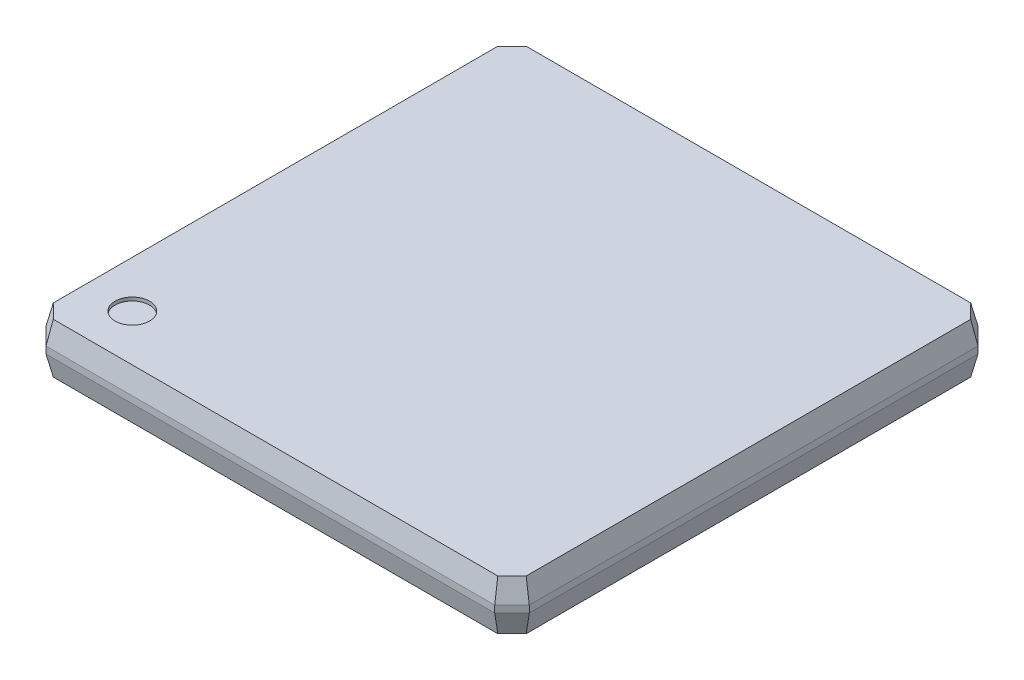
ISO-10303-21;
HEADER;
FILE_DESCRIPTION(('STEP AP214'),'2;1');
FILE_NAME('part.step','',(''),(''),'','','');
FILE_SCHEMA(('AUTOMOTIVE_DESIGN { 1 0 10303 214 1 1 1 1 }'));
ENDSEC;
DATA;
#1=APPLICATION_CONTEXT('core data for automotive mechanical design processes');
#2=APPLICATION_PROTOCOL_DEFINITION('international standard','automotive_design',2000,#1);
#3=PRODUCT_CONTEXT('',#1,'mechanical');
#4=PRODUCT('Part','Part','',(#3));
#5=PRODUCT_RELATED_PRODUCT_CATEGORY('part','',(#4));
#6=PRODUCT_DEFINITION_FORMATION('','',#4);
#7=PRODUCT_DEFINITION_CONTEXT('part definition',#1,'design');
#8=PRODUCT_DEFINITION('design','',#6,#7);
#9=PRODUCT_DEFINITION_SHAPE('','',#8);
#10=(LENGTH_UNIT() NAMED_UNIT(*) SI_UNIT(.MILLI.,.METRE.));
#11=(NAMED_UNIT(*) PLANE_ANGLE_UNIT() SI_UNIT($,.RADIAN.));
#12=(NAMED_UNIT(*) SI_UNIT($,.STERADIAN.) SOLID_ANGLE_UNIT());
#13=UNCERTAINTY_MEASURE_WITH_UNIT(LENGTH_MEASURE(1.E-05),#10,'distance_accuracy_value','');
#14=(GEOMETRIC_REPRESENTATION_CONTEXT(3) GLOBAL_UNCERTAINTY_ASSIGNED_CONTEXT((#13)) GLOBAL_UNIT_ASSIGNED_CONTEXT((#10,
#11,#12)) REPRESENTATION_CONTEXT('',''));
#15=CARTESIAN_POINT('',(0.,0.,0.));
#16=DIRECTION('',(0.,0.,1.));
#17=DIRECTION('',(1.,0.,0.));
#18=AXIS2_PLACEMENT_3D('',#15,#16,#17);
#19=CARTESIAN_POINT('',(-5.5,1.5,5.5));
#20=DIRECTION('',(0.,1.,0.));
#21=DIRECTION('',(0.,0.,1.));
#22=AXIS2_PLACEMENT_3D('',#19,#20,#21);
#23=PLANE('',#22);
#24=CARTESIAN_POINT('',(-5.5,1.5,5.5));
#25=DIRECTION('',(0.,-1.,0.));
#26=DIRECTION('',(0.,0.,-1.));
#27=AXIS2_PLACEMENT_3D('',#24,#25,#26);
#28=CIRCLE('',#27,0.5);
#29=CARTESIAN_POINT('',(-5.5,1.5,5.));
#30=VERTEX_POINT('',#29);
#31=EDGE_CURVE('E19',#30,#30,#28,.F.);
#32=ORIENTED_EDGE('',*,*,#31,.T.);
#33=EDGE_LOOP('',(#32));
#34=FACE_BOUND('',#33,.T.);
#35=ADVANCED_FACE('F16',(#34),#23,.T.);
#36=CARTESIAN_POINT('',(-5.5,1.6,5.5));
#37=DIRECTION('',(0.,-1.,0.));
#38=DIRECTION('',(0.,0.,-1.));
#39=AXIS2_PLACEMENT_3D('',#36,#37,#38);
#40=CYLINDRICAL_SURFACE('',#39,0.5);
#41=CARTESIAN_POINT('',(-5.5,1.6,5.5));
#42=DIRECTION('',(0.,-1.,0.));
#43=DIRECTION('',(0.,0.,-1.));
#44=AXIS2_PLACEMENT_3D('',#41,#42,#43);
#45=CIRCLE('',#44,0.5);
#46=CARTESIAN_POINT('',(-5.5,1.6,5.));
#47=VERTEX_POINT('',#46);
#48=EDGE_CURVE('E141',#47,#47,#45,.T.);
#49=ORIENTED_EDGE('',*,*,#48,.F.);
#50=EDGE_LOOP('',(#49));
#51=FACE_BOUND('',#50,.T.);
#52=ORIENTED_EDGE('',*,*,#31,.F.);
#53=EDGE_LOOP('',(#52));
#54=FACE_BOUND('',#53,.T.);
#55=ADVANCED_FACE('F163',(#51,#54),#40,.F.);
#56=CARTESIAN_POINT('',(0.,1.6,-7.));
#57=DIRECTION('',(0.,1.,0.));
#58=DIRECTION('',(0.,0.,1.));
#59=AXIS2_PLACEMENT_3D('',#56,#57,#58);
#60=PLANE('',#59);
#61=DIRECTION('',(0.707106781186548,0.,0.707106781186548));
#62=VECTOR('',#61,1.);
#63=CARTESIAN_POINT('',(-8.39393398282202,1.6,4.89393398282202));
#64=LINE('',#63,#62);
#65=CARTESIAN_POINT('',(-6.43786796564403,1.6,6.85));
#66=VERTEX_POINT('',#65);
#67=CARTESIAN_POINT('',(-6.85,1.6,6.43786796564403));
#68=VERTEX_POINT('',#67);
#69=EDGE_CURVE('E146',#66,#68,#64,.F.);
#70=ORIENTED_EDGE('',*,*,#69,.F.);
#71=DIRECTION('',(1.,0.,0.));
#72=VECTOR('',#71,1.);
#73=CARTESIAN_POINT('',(0.,1.6,6.85));
#74=LINE('',#73,#72);
#75=CARTESIAN_POINT('',(6.43786796564403,1.6,6.85));
#76=VERTEX_POINT('',#75);
#77=EDGE_CURVE('E127',#76,#66,#74,.F.);
#78=ORIENTED_EDGE('',*,*,#77,.F.);
#79=DIRECTION('',(0.707106781186548,0.,-0.707106781186548));
#80=VECTOR('',#79,1.);
#81=CARTESIAN_POINT('',(8.39393398282202,1.6,4.89393398282202));
#82=LINE('',#81,#80);
#83=CARTESIAN_POINT('',(6.85,1.6,6.43786796564403));
#84=VERTEX_POINT('',#83);
#85=EDGE_CURVE('E132',#84,#76,#82,.F.);
#86=ORIENTED_EDGE('',*,*,#85,.F.);
#87=DIRECTION('',(0.,0.,1.));
#88=VECTOR('',#87,1.);
#89=CARTESIAN_POINT('',(6.85,1.6,-7.));
#90=LINE('',#89,#88);
#91=CARTESIAN_POINT('',(6.85,1.6,-6.43786796564403));
#92=VERTEX_POINT('',#91);
#93=EDGE_CURVE('E471',#92,#84,#90,.T.);
#94=ORIENTED_EDGE('',*,*,#93,.F.);
#95=DIRECTION('',(-0.707106781186548,0.,-0.707106781186547));
#96=VECTOR('',#95,1.);
#97=CARTESIAN_POINT('',(4.89393398282202,1.6,-8.39393398282202));
#98=LINE('',#97,#96);
#99=CARTESIAN_POINT('',(6.43786796564403,1.6,-6.85));
#100=VERTEX_POINT('',#99);
#101=EDGE_CURVE('E465',#100,#92,#98,.F.);
#102=ORIENTED_EDGE('',*,*,#101,.F.);
#103=DIRECTION('',(1.,0.,0.));
#104=VECTOR('',#103,1.);
#105=CARTESIAN_POINT('',(0.,1.6,-6.85));
#106=LINE('',#105,#104);
#107=CARTESIAN_POINT('',(-6.43786796564403,1.6,-6.85));
#108=VERTEX_POINT('',#107);
#109=EDGE_CURVE('E460',#108,#100,#106,.T.);
#110=ORIENTED_EDGE('',*,*,#109,.F.);
#111=DIRECTION('',(-0.707106781186548,0.,0.707106781186547));
#112=VECTOR('',#111,1.);
#113=CARTESIAN_POINT('',(-4.89393398282202,1.6,-8.39393398282202));
#114=LINE('',#113,#112);
#115=CARTESIAN_POINT('',(-6.85,1.6,-6.43786796564403));
#116=VERTEX_POINT('',#115);
#117=EDGE_CURVE('E455',#116,#108,#114,.F.);
#118=ORIENTED_EDGE('',*,*,#117,.F.);
#119=DIRECTION('',(0.,0.,1.));
#120=VECTOR('',#119,1.);
#121=CARTESIAN_POINT('',(-6.85,1.6,-7.));
#122=LINE('',#121,#120);
#123=EDGE_CURVE('E450',#68,#116,#122,.F.);
#124=ORIENTED_EDGE('',*,*,#123,.F.);
#125=EDGE_LOOP('',(#70,#78,#86,#94,#102,#110,#118,#124));
#126=FACE_BOUND('',#125,.T.);
#127=ORIENTED_EDGE('',*,*,#48,.T.);
#128=EDGE_LOOP('',(#127));
#129=FACE_BOUND('',#128,.T.);
#130=ADVANCED_FACE('F143',(#126,#129),#60,.T.);
#131=CARTESIAN_POINT('',(8.44696699141101,1.2875,4.94696699141101));
#132=DIRECTION('',(0.687581655170114,0.233372952475328,0.687581655170114));
#133=DIRECTION('',(0.707106781186548,0.,-0.707106781186548));
#134=AXIS2_PLACEMENT_3D('',#131,#132,#133);
#135=PLANE('',#134);
#136=DIRECTION('',(0.232290174282964,-0.967875726179023,0.0962177405940241));
#137=VECTOR('',#136,1.);
#138=CARTESIAN_POINT('',(6.85,1.6,6.43786796564403));
#139=LINE('',#138,#137);
#140=CARTESIAN_POINT('',(7.,0.975,6.5));
#141=VERTEX_POINT('',#140);
#142=EDGE_CURVE('E137',#84,#141,#139,.T.);
#143=ORIENTED_EDGE('',*,*,#142,.F.);
#144=ORIENTED_EDGE('',*,*,#85,.T.);
#145=DIRECTION('',(-0.0962177405940241,0.967875726179022,-0.232290174282967));
#146=VECTOR('',#145,1.);
#147=CARTESIAN_POINT('',(6.5,0.975,7.));
#148=LINE('',#147,#146);
#149=CARTESIAN_POINT('',(6.5,0.975,7.));
#150=VERTEX_POINT('',#149);
#151=EDGE_CURVE('E134',#150,#76,#148,.T.);
#152=ORIENTED_EDGE('',*,*,#151,.F.);
#153=DIRECTION('',(0.707106781186547,0.,-0.707106781186548));
#154=VECTOR('',#153,1.);
#155=CARTESIAN_POINT('',(6.75,0.974999999999999,6.75));
#156=LINE('',#155,#154);
#157=EDGE_CURVE('E473',#141,#150,#156,.F.);
#158=ORIENTED_EDGE('',*,*,#157,.F.);
#159=EDGE_LOOP('',(#143,#144,#152,#158));
#160=FACE_BOUND('',#159,.T.);
#161=ADVANCED_FACE('F133',(#160),#135,.T.);
#162=CARTESIAN_POINT('',(0.,1.2875,6.925));
#163=DIRECTION('',(0.,0.233372952475326,0.972387301980517));
#164=DIRECTION('',(0.,-0.972387301980517,0.233372952475326));
#165=AXIS2_PLACEMENT_3D('',#162,#163,#164);
#166=PLANE('',#165);
#167=DIRECTION('',(0.096217740594024,0.967875726179024,-0.232290174282962));
#168=VECTOR('',#167,1.);
#169=CARTESIAN_POINT('',(-6.5,0.975,7.));
#170=LINE('',#169,#168);
#171=CARTESIAN_POINT('',(-6.5,0.975,7.));
#172=VERTEX_POINT('',#171);
#173=EDGE_CURVE('E148',#172,#66,#170,.T.);
#174=ORIENTED_EDGE('',*,*,#173,.F.);
#175=DIRECTION('',(1.,0.,0.));
#176=VECTOR('',#175,1.);
#177=CARTESIAN_POINT('',(0.,0.974999999999999,7.));
#178=LINE('',#177,#176);
#179=EDGE_CURVE('E153',#150,#172,#178,.F.);
#180=ORIENTED_EDGE('',*,*,#179,.F.);
#181=ORIENTED_EDGE('',*,*,#151,.T.);
#182=ORIENTED_EDGE('',*,*,#77,.T.);
#183=EDGE_LOOP('',(#174,#180,#181,#182));
#184=FACE_BOUND('',#183,.T.);
#185=ADVANCED_FACE('F151',(#184),#166,.T.);
#186=CARTESIAN_POINT('',(-8.44696699141101,1.2875,4.94696699141101));
#187=DIRECTION('',(-0.687581655170114,0.233372952475328,0.687581655170114));
#188=DIRECTION('',(0.707106781186548,0.,0.707106781186548));
#189=AXIS2_PLACEMENT_3D('',#186,#187,#188);
#190=PLANE('',#189);
#191=ORIENTED_EDGE('',*,*,#173,.T.);
#192=ORIENTED_EDGE('',*,*,#69,.T.);
#193=DIRECTION('',(0.232290174282964,0.967875726179023,-0.0962177405940241));
#194=VECTOR('',#193,1.);
#195=CARTESIAN_POINT('',(-7.,0.975,6.5));
#196=LINE('',#195,#194);
#197=CARTESIAN_POINT('',(-7.,0.975,6.5));
#198=VERTEX_POINT('',#197);
#199=EDGE_CURVE('E445',#198,#68,#196,.T.);
#200=ORIENTED_EDGE('',*,*,#199,.F.);
#201=DIRECTION('',(0.707106781186547,0.,0.707106781186548));
#202=VECTOR('',#201,1.);
#203=CARTESIAN_POINT('',(-6.75,0.974999999999999,6.75));
#204=LINE('',#203,#202);
#205=EDGE_CURVE('E443',#172,#198,#204,.F.);
#206=ORIENTED_EDGE('',*,*,#205,.F.);
#207=EDGE_LOOP('',(#191,#192,#200,#206));
#208=FACE_BOUND('',#207,.T.);
#209=ADVANCED_FACE('F262',(#208),#190,.T.);
#210=CARTESIAN_POINT('',(-6.925,1.2875,-7.));
#211=DIRECTION('',(-0.972387301980518,0.233372952475323,0.));
#212=DIRECTION('',(-0.233372952475323,-0.972387301980518,0.));
#213=AXIS2_PLACEMENT_3D('',#210,#211,#212);
#214=PLANE('',#213);
#215=DIRECTION('',(0.23229017428296,0.967875726179024,0.0962177405940227));
#216=VECTOR('',#215,1.);
#217=CARTESIAN_POINT('',(-7.,0.975,-6.5));
#218=LINE('',#217,#216);
#219=CARTESIAN_POINT('',(-7.,0.974999999999999,-6.5));
#220=VERTEX_POINT('',#219);
#221=EDGE_CURVE('E452',#220,#116,#218,.T.);
#222=ORIENTED_EDGE('',*,*,#221,.F.);
#223=DIRECTION('',(0.,0.,1.));
#224=VECTOR('',#223,1.);
#225=CARTESIAN_POINT('',(-7.,0.974999999999999,-7.));
#226=LINE('',#225,#224);
#227=EDGE_CURVE('E484',#198,#220,#226,.F.);
#228=ORIENTED_EDGE('',*,*,#227,.F.);
#229=ORIENTED_EDGE('',*,*,#199,.T.);
#230=ORIENTED_EDGE('',*,*,#123,.T.);
#231=EDGE_LOOP('',(#222,#228,#229,#230));
#232=FACE_BOUND('',#231,.T.);
#233=ADVANCED_FACE('F258',(#232),#214,.T.);
#234=CARTESIAN_POINT('',(-4.94696699141101,1.2875,-8.44696699141101));
#235=DIRECTION('',(-0.687581655170115,0.233372952475326,-0.687581655170115));
#236=DIRECTION('',(-0.707106781186548,0.,0.707106781186547));
#237=AXIS2_PLACEMENT_3D('',#234,#235,#236);
#238=PLANE('',#237);
#239=ORIENTED_EDGE('',*,*,#221,.T.);
#240=ORIENTED_EDGE('',*,*,#117,.T.);
#241=DIRECTION('',(0.096217740594024,0.967875726179023,0.232290174282965));
#242=VECTOR('',#241,1.);
#243=CARTESIAN_POINT('',(-6.5,0.974999999999999,-7.));
#244=LINE('',#243,#242);
#245=CARTESIAN_POINT('',(-6.5,0.974999999999999,-7.));
#246=VERTEX_POINT('',#245);
#247=EDGE_CURVE('E457',#246,#108,#244,.T.);
#248=ORIENTED_EDGE('',*,*,#247,.F.);
#249=DIRECTION('',(-0.707106781186547,0.,0.707106781186548));
#250=VECTOR('',#249,1.);
#251=CARTESIAN_POINT('',(-6.75,0.974999999999999,-6.75));
#252=LINE('',#251,#250);
#253=EDGE_CURVE('E490',#220,#246,#252,.F.);
#254=ORIENTED_EDGE('',*,*,#253,.F.);
#255=EDGE_LOOP('',(#239,#240,#248,#254));
#256=FACE_BOUND('',#255,.T.);
#257=ADVANCED_FACE('F254',(#256),#238,.T.);
#258=CARTESIAN_POINT('',(0.,1.2875,-6.925));
#259=DIRECTION('',(0.,0.233372952475324,-0.972387301980518));
#260=DIRECTION('',(0.,0.972387301980518,0.233372952475324));
#261=AXIS2_PLACEMENT_3D('',#258,#259,#260);
#262=PLANE('',#261);
#263=DIRECTION('',(-0.0962177405940227,0.967875726179024,0.23229017428296));
#264=VECTOR('',#263,1.);
#265=CARTESIAN_POINT('',(6.5,0.975,-7.));
#266=LINE('',#265,#264);
#267=CARTESIAN_POINT('',(6.5,0.974999999999999,-7.));
#268=VERTEX_POINT('',#267);
#269=EDGE_CURVE('E462',#268,#100,#266,.T.);
#270=ORIENTED_EDGE('',*,*,#269,.F.);
#271=DIRECTION('',(1.,0.,0.));
#272=VECTOR('',#271,1.);
#273=CARTESIAN_POINT('',(0.,0.974999999999999,-7.));
#274=LINE('',#273,#272);
#275=EDGE_CURVE('E493',#268,#246,#274,.F.);
#276=ORIENTED_EDGE('',*,*,#275,.T.);
#277=ORIENTED_EDGE('',*,*,#247,.T.);
#278=ORIENTED_EDGE('',*,*,#109,.T.);
#279=EDGE_LOOP('',(#270,#276,#277,#278));
#280=FACE_BOUND('',#279,.T.);
#281=ADVANCED_FACE('F250',(#280),#262,.T.);
#282=CARTESIAN_POINT('',(4.94696699141101,1.2875,-8.44696699141101));
#283=DIRECTION('',(0.687581655170115,0.233372952475326,-0.687581655170115));
#284=DIRECTION('',(-0.707106781186548,0.,-0.707106781186547));
#285=AXIS2_PLACEMENT_3D('',#282,#283,#284);
#286=PLANE('',#285);
#287=ORIENTED_EDGE('',*,*,#269,.T.);
#288=ORIENTED_EDGE('',*,*,#101,.T.);
#289=DIRECTION('',(-0.232290174282964,0.967875726179023,0.0962177405940241));
#290=VECTOR('',#289,1.);
#291=CARTESIAN_POINT('',(7.,0.975,-6.5));
#292=LINE('',#291,#290);
#293=CARTESIAN_POINT('',(7.,0.975,-6.5));
#294=VERTEX_POINT('',#293);
#295=EDGE_CURVE('E468',#294,#92,#292,.T.);
#296=ORIENTED_EDGE('',*,*,#295,.F.);
#297=DIRECTION('',(-0.707106781186547,0.,-0.707106781186548));
#298=VECTOR('',#297,1.);
#299=CARTESIAN_POINT('',(6.75,0.974999999999999,-6.75));
#300=LINE('',#299,#298);
#301=EDGE_CURVE('E501',#268,#294,#300,.F.);
#302=ORIENTED_EDGE('',*,*,#301,.F.);
#303=EDGE_LOOP('',(#287,#288,#296,#302));
#304=FACE_BOUND('',#303,.T.);
#305=ADVANCED_FACE('F246',(#304),#286,.T.);
#306=CARTESIAN_POINT('',(6.925,1.2875,-7.));
#307=DIRECTION('',(0.972387301980518,0.233372952475323,0.));
#308=DIRECTION('',(-0.233372952475323,0.972387301980518,0.));
#309=AXIS2_PLACEMENT_3D('',#306,#307,#308);
#310=PLANE('',#309);
#311=ORIENTED_EDGE('',*,*,#295,.T.);
#312=ORIENTED_EDGE('',*,*,#93,.T.);
#313=ORIENTED_EDGE('',*,*,#142,.T.);
#314=DIRECTION('',(0.,0.,-1.));
#315=VECTOR('',#314,1.);
#316=CARTESIAN_POINT('',(7.,0.974999999999999,-7.));
#317=LINE('',#316,#315);
#318=EDGE_CURVE('E510',#294,#141,#317,.F.);
#319=ORIENTED_EDGE('',*,*,#318,.F.);
#320=EDGE_LOOP('',(#311,#312,#313,#319));
#321=FACE_BOUND('',#320,.T.);
#322=ADVANCED_FACE('F242',(#321),#310,.T.);
#323=CARTESIAN_POINT('',(6.75,0.875,6.75));
#324=DIRECTION('',(0.707106781186548,0.,0.707106781186547));
#325=DIRECTION('',(0.707106781186547,0.,-0.707106781186548));
#326=AXIS2_PLACEMENT_3D('',#323,#324,#325);
#327=PLANE('',#326);
#328=ORIENTED_EDGE('',*,*,#157,.T.);
#329=DIRECTION('',(0.,-1.,0.));
#330=VECTOR('',#329,1.);
#331=CARTESIAN_POINT('',(6.5,0.874999999999999,7.));
#332=LINE('',#331,#330);
#333=CARTESIAN_POINT('',(6.5,0.775,7.));
#334=VERTEX_POINT('',#333);
#335=EDGE_CURVE('E475',#334,#150,#332,.F.);
#336=ORIENTED_EDGE('',*,*,#335,.F.);
#337=DIRECTION('',(0.707106781186548,0.,-0.707106781186548));
#338=VECTOR('',#337,1.);
#339=CARTESIAN_POINT('',(8.5,0.775,5.));
#340=LINE('',#339,#338);
#341=CARTESIAN_POINT('',(7.,0.775000000000001,6.5));
#342=VERTEX_POINT('',#341);
#343=EDGE_CURVE('E513',#342,#334,#340,.F.);
#344=ORIENTED_EDGE('',*,*,#343,.F.);
#345=DIRECTION('',(0.,1.,0.));
#346=VECTOR('',#345,1.);
#347=CARTESIAN_POINT('',(7.,0.875,6.5));
#348=LINE('',#347,#346);
#349=EDGE_CURVE('E504',#141,#342,#348,.F.);
#350=ORIENTED_EDGE('',*,*,#349,.F.);
#351=EDGE_LOOP('',(#328,#336,#344,#350));
#352=FACE_BOUND('',#351,.T.);
#353=ADVANCED_FACE('F238',(#352),#327,.T.);
#354=CARTESIAN_POINT('',(0.,0.874999999999999,7.));
#355=DIRECTION('',(0.,0.,1.));
#356=DIRECTION('',(0.,-1.,0.));
#357=AXIS2_PLACEMENT_3D('',#354,#355,#356);
#358=PLANE('',#357);
#359=DIRECTION('',(0.,1.,0.));
#360=VECTOR('',#359,1.);
#361=CARTESIAN_POINT('',(-6.5,0.874999999999999,7.));
#362=LINE('',#361,#360);
#363=CARTESIAN_POINT('',(-6.5,0.774999999999999,7.));
#364=VERTEX_POINT('',#363);
#365=EDGE_CURVE('E478',#364,#172,#362,.T.);
#366=ORIENTED_EDGE('',*,*,#365,.F.);
#367=DIRECTION('',(1.,0.,0.));
#368=VECTOR('',#367,1.);
#369=CARTESIAN_POINT('',(0.,0.775,7.));
#370=LINE('',#369,#368);
#371=EDGE_CURVE('E519',#334,#364,#370,.F.);
#372=ORIENTED_EDGE('',*,*,#371,.F.);
#373=ORIENTED_EDGE('',*,*,#335,.T.);
#374=ORIENTED_EDGE('',*,*,#179,.T.);
#375=EDGE_LOOP('',(#366,#372,#373,#374));
#376=FACE_BOUND('',#375,.T.);
#377=ADVANCED_FACE('F234',(#376),#358,.T.);
#378=CARTESIAN_POINT('',(-6.75,0.874999999999999,6.75));
#379=DIRECTION('',(-0.707106781186548,0.,0.707106781186547));
#380=DIRECTION('',(0.707106781186547,0.,0.707106781186548));
#381=AXIS2_PLACEMENT_3D('',#378,#379,#380);
#382=PLANE('',#381);
#383=ORIENTED_EDGE('',*,*,#205,.T.);
#384=DIRECTION('',(0.,1.,0.));
#385=VECTOR('',#384,1.);
#386=CARTESIAN_POINT('',(-7.,0.874999999999999,6.5));
#387=LINE('',#386,#385);
#388=CARTESIAN_POINT('',(-7.,0.774999999999999,6.5));
#389=VERTEX_POINT('',#388);
#390=EDGE_CURVE('E481',#389,#198,#387,.T.);
#391=ORIENTED_EDGE('',*,*,#390,.F.);
#392=DIRECTION('',(0.707106781186548,0.,0.707106781186548));
#393=VECTOR('',#392,1.);
#394=CARTESIAN_POINT('',(-8.5,0.774999999999998,5.));
#395=LINE('',#394,#393);
#396=EDGE_CURVE('E525',#364,#389,#395,.F.);
#397=ORIENTED_EDGE('',*,*,#396,.F.);
#398=ORIENTED_EDGE('',*,*,#365,.T.);
#399=EDGE_LOOP('',(#383,#391,#397,#398));
#400=FACE_BOUND('',#399,.T.);
#401=ADVANCED_FACE('F230',(#400),#382,.T.);
#402=CARTESIAN_POINT('',(-7.,0.874999999999999,-7.));
#403=DIRECTION('',(-1.,0.,0.));
#404=DIRECTION('',(0.,0.,1.));
#405=AXIS2_PLACEMENT_3D('',#402,#403,#404);
#406=PLANE('',#405);
#407=DIRECTION('',(0.,1.,0.));
#408=VECTOR('',#407,1.);
#409=CARTESIAN_POINT('',(-7.,0.874999999999999,-6.5));
#410=LINE('',#409,#408);
#411=CARTESIAN_POINT('',(-7.,0.774999999999999,-6.5));
#412=VERTEX_POINT('',#411);
#413=EDGE_CURVE('E487',#412,#220,#410,.T.);
#414=ORIENTED_EDGE('',*,*,#413,.F.);
#415=DIRECTION('',(0.,0.,1.));
#416=VECTOR('',#415,1.);
#417=CARTESIAN_POINT('',(-7.,0.774999999999999,-7.));
#418=LINE('',#417,#416);
#419=EDGE_CURVE('E531',#389,#412,#418,.F.);
#420=ORIENTED_EDGE('',*,*,#419,.F.);
#421=ORIENTED_EDGE('',*,*,#390,.T.);
#422=ORIENTED_EDGE('',*,*,#227,.T.);
#423=EDGE_LOOP('',(#414,#420,#421,#422));
#424=FACE_BOUND('',#423,.T.);
#425=ADVANCED_FACE('F226',(#424),#406,.T.);
#426=CARTESIAN_POINT('',(-6.75,0.874999999999999,-6.75));
#427=DIRECTION('',(-0.707106781186548,0.,-0.707106781186547));
#428=DIRECTION('',(-0.707106781186547,0.,0.707106781186548));
#429=AXIS2_PLACEMENT_3D('',#426,#427,#428);
#430=PLANE('',#429);
#431=ORIENTED_EDGE('',*,*,#253,.T.);
#432=DIRECTION('',(0.,-1.,0.));
#433=VECTOR('',#432,1.);
#434=CARTESIAN_POINT('',(-6.5,0.874999999999999,-7.));
#435=LINE('',#434,#433);
#436=CARTESIAN_POINT('',(-6.5,0.774999999999999,-7.));
#437=VERTEX_POINT('',#436);
#438=EDGE_CURVE('E496',#246,#437,#435,.T.);
#439=ORIENTED_EDGE('',*,*,#438,.T.);
#440=DIRECTION('',(-0.707106781186548,0.,0.707106781186547));
#441=VECTOR('',#440,1.);
#442=CARTESIAN_POINT('',(-5.,0.774999999999998,-8.5));
#443=LINE('',#442,#441);
#444=EDGE_CURVE('E537',#412,#437,#443,.F.);
#445=ORIENTED_EDGE('',*,*,#444,.F.);
#446=ORIENTED_EDGE('',*,*,#413,.T.);
#447=EDGE_LOOP('',(#431,#439,#445,#446));
#448=FACE_BOUND('',#447,.T.);
#449=ADVANCED_FACE('F222',(#448),#430,.T.);
#450=CARTESIAN_POINT('',(0.,0.874999999999999,-7.));
#451=DIRECTION('',(0.,0.,1.));
#452=DIRECTION('',(0.,-1.,0.));
#453=AXIS2_PLACEMENT_3D('',#450,#451,#452);
#454=PLANE('',#453);
#455=ORIENTED_EDGE('',*,*,#275,.F.);
#456=DIRECTION('',(0.,1.,0.));
#457=VECTOR('',#456,1.);
#458=CARTESIAN_POINT('',(6.5,0.875,-7.));
#459=LINE('',#458,#457);
#460=CARTESIAN_POINT('',(6.5,0.774999999999999,-7.));
#461=VERTEX_POINT('',#460);
#462=EDGE_CURVE('E498',#461,#268,#459,.T.);
#463=ORIENTED_EDGE('',*,*,#462,.F.);
#464=DIRECTION('',(1.,0.,0.));
#465=VECTOR('',#464,1.);
#466=CARTESIAN_POINT('',(0.,0.774999999999999,-7.));
#467=LINE('',#466,#465);
#468=EDGE_CURVE('E543',#437,#461,#467,.T.);
#469=ORIENTED_EDGE('',*,*,#468,.F.);
#470=ORIENTED_EDGE('',*,*,#438,.F.);
#471=EDGE_LOOP('',(#455,#463,#469,#470));
#472=FACE_BOUND('',#471,.T.);
#473=ADVANCED_FACE('F218',(#472),#454,.F.);
#474=CARTESIAN_POINT('',(6.75,0.875,-6.75));
#475=DIRECTION('',(0.707106781186548,0.,-0.707106781186547));
#476=DIRECTION('',(-0.707106781186547,0.,-0.707106781186548));
#477=AXIS2_PLACEMENT_3D('',#474,#475,#476);
#478=PLANE('',#477);
#479=ORIENTED_EDGE('',*,*,#301,.T.);
#480=DIRECTION('',(0.,1.,0.));
#481=VECTOR('',#480,1.);
#482=CARTESIAN_POINT('',(7.,0.875,-6.5));
#483=LINE('',#482,#481);
#484=CARTESIAN_POINT('',(7.,0.775000000000001,-6.5));
#485=VERTEX_POINT('',#484);
#486=EDGE_CURVE('E507',#485,#294,#483,.T.);
#487=ORIENTED_EDGE('',*,*,#486,.F.);
#488=DIRECTION('',(-0.707106781186548,0.,-0.707106781186547));
#489=VECTOR('',#488,1.);
#490=CARTESIAN_POINT('',(5.,0.775,-8.5));
#491=LINE('',#490,#489);
#492=EDGE_CURVE('E549',#461,#485,#491,.F.);
#493=ORIENTED_EDGE('',*,*,#492,.F.);
#494=ORIENTED_EDGE('',*,*,#462,.T.);
#495=EDGE_LOOP('',(#479,#487,#493,#494));
#496=FACE_BOUND('',#495,.T.);
#497=ADVANCED_FACE('F214',(#496),#478,.T.);
#498=CARTESIAN_POINT('',(7.,0.875,-7.));
#499=DIRECTION('',(1.,0.,0.));
#500=DIRECTION('',(0.,0.,-1.));
#501=AXIS2_PLACEMENT_3D('',#498,#499,#500);
#502=PLANE('',#501);
#503=ORIENTED_EDGE('',*,*,#486,.T.);
#504=ORIENTED_EDGE('',*,*,#318,.T.);
#505=ORIENTED_EDGE('',*,*,#349,.T.);
#506=DIRECTION('',(0.,0.,1.));
#507=VECTOR('',#506,1.);
#508=CARTESIAN_POINT('',(7.,0.775000000000001,-7.));
#509=LINE('',#508,#507);
#510=EDGE_CURVE('E555',#485,#342,#509,.T.);
#511=ORIENTED_EDGE('',*,*,#510,.F.);
#512=EDGE_LOOP('',(#503,#504,#505,#511));
#513=FACE_BOUND('',#512,.T.);
#514=ADVANCED_FACE('F210',(#513),#502,.T.);
#515=CARTESIAN_POINT('',(8.44696699141101,0.462500000000001,4.94696699141101));
#516=DIRECTION('',(0.687581655170114,-0.233372952475328,0.687581655170114));
#517=DIRECTION('',(0.707106781186548,0.,-0.707106781186548));
#518=AXIS2_PLACEMENT_3D('',#515,#516,#517);
#519=PLANE('',#518);
#520=DIRECTION('',(0.0962177405940242,0.967875726179022,0.232290174282967));
#521=VECTOR('',#520,1.);
#522=CARTESIAN_POINT('',(6.43786796564403,0.150000000000001,6.85));
#523=LINE('',#522,#521);
#524=CARTESIAN_POINT('',(6.43786796564403,0.15,6.85));
#525=VERTEX_POINT('',#524);
#526=EDGE_CURVE('E516',#525,#334,#523,.T.);
#527=ORIENTED_EDGE('',*,*,#526,.F.);
#528=DIRECTION('',(-0.707106781186547,0.,0.707106781186548));
#529=VECTOR('',#528,1.);
#530=CARTESIAN_POINT('',(6.85,0.150000000000001,6.43786796564403));
#531=LINE('',#530,#529);
#532=CARTESIAN_POINT('',(6.85,0.15,6.43786796564403));
#533=VERTEX_POINT('',#532);
#534=EDGE_CURVE('E558',#533,#525,#531,.T.);
#535=ORIENTED_EDGE('',*,*,#534,.F.);
#536=DIRECTION('',(-0.232290174282964,-0.967875726179023,-0.0962177405940242));
#537=VECTOR('',#536,1.);
#538=CARTESIAN_POINT('',(7.,0.775000000000001,6.5));
#539=LINE('',#538,#537);
#540=EDGE_CURVE('E551',#342,#533,#539,.T.);
#541=ORIENTED_EDGE('',*,*,#540,.F.);
#542=ORIENTED_EDGE('',*,*,#343,.T.);
#543=EDGE_LOOP('',(#527,#535,#541,#542));
#544=FACE_BOUND('',#543,.T.);
#545=ADVANCED_FACE('F206',(#544),#519,.T.);
#546=CARTESIAN_POINT('',(0.,0.4625,6.925));
#547=DIRECTION('',(0.,-0.233372952475326,0.972387301980517));
#548=DIRECTION('',(0.,-0.972387301980517,-0.233372952475326));
#549=AXIS2_PLACEMENT_3D('',#546,#547,#548);
#550=PLANE('',#549);
#551=DIRECTION('',(-0.0962177405940228,0.967875726179024,0.232290174282961));
#552=VECTOR('',#551,1.);
#553=CARTESIAN_POINT('',(-6.43786796564403,0.149999999999998,6.85));
#554=LINE('',#553,#552);
#555=CARTESIAN_POINT('',(-6.43786796564403,0.149999999999999,6.85));
#556=VERTEX_POINT('',#555);
#557=EDGE_CURVE('E522',#556,#364,#554,.T.);
#558=ORIENTED_EDGE('',*,*,#557,.F.);
#559=DIRECTION('',(1.,0.,0.));
#560=VECTOR('',#559,1.);
#561=CARTESIAN_POINT('',(0.,0.15,6.85));
#562=LINE('',#561,#560);
#563=EDGE_CURVE('E561',#525,#556,#562,.F.);
#564=ORIENTED_EDGE('',*,*,#563,.F.);
#565=ORIENTED_EDGE('',*,*,#526,.T.);
#566=ORIENTED_EDGE('',*,*,#371,.T.);
#567=EDGE_LOOP('',(#558,#564,#565,#566));
#568=FACE_BOUND('',#567,.T.);
#569=ADVANCED_FACE('F202',(#568),#550,.T.);
#570=CARTESIAN_POINT('',(-8.44696699141101,0.462499999999999,4.94696699141101));
#571=DIRECTION('',(-0.687581655170114,-0.233372952475328,0.687581655170114));
#572=DIRECTION('',(0.707106781186548,0.,0.707106781186548));
#573=AXIS2_PLACEMENT_3D('',#570,#571,#572);
#574=PLANE('',#573);
#575=DIRECTION('',(-0.232290174282964,0.967875726179023,0.0962177405940242));
#576=VECTOR('',#575,1.);
#577=CARTESIAN_POINT('',(-6.85,0.149999999999999,6.43786796564403));
#578=LINE('',#577,#576);
#579=CARTESIAN_POINT('',(-6.85,0.149999999999998,6.43786796564403));
#580=VERTEX_POINT('',#579);
#581=EDGE_CURVE('E528',#580,#389,#578,.T.);
#582=ORIENTED_EDGE('',*,*,#581,.F.);
#583=DIRECTION('',(-0.707106781186547,0.,-0.707106781186548));
#584=VECTOR('',#583,1.);
#585=CARTESIAN_POINT('',(-6.43786796564403,0.149999999999999,6.85));
#586=LINE('',#585,#584);
#587=EDGE_CURVE('E564',#556,#580,#586,.T.);
#588=ORIENTED_EDGE('',*,*,#587,.F.);
#589=ORIENTED_EDGE('',*,*,#557,.T.);
#590=ORIENTED_EDGE('',*,*,#396,.T.);
#591=EDGE_LOOP('',(#582,#588,#589,#590));
#592=FACE_BOUND('',#591,.T.);
#593=ADVANCED_FACE('F198',(#592),#574,.T.);
#594=CARTESIAN_POINT('',(-6.925,0.462499999999999,-7.));
#595=DIRECTION('',(-0.972387301980518,-0.233372952475323,0.));
#596=DIRECTION('',(0.233372952475323,-0.972387301980518,0.));
#597=AXIS2_PLACEMENT_3D('',#594,#595,#596);
#598=PLANE('',#597);
#599=DIRECTION('',(-0.23229017428296,0.967875726179024,-0.0962177405940229));
#600=VECTOR('',#599,1.);
#601=CARTESIAN_POINT('',(-6.85,0.149999999999998,-6.43786796564403));
#602=LINE('',#601,#600);
#603=CARTESIAN_POINT('',(-6.85,0.149999999999999,-6.43786796564403));
#604=VERTEX_POINT('',#603);
#605=EDGE_CURVE('E534',#604,#412,#602,.T.);
#606=ORIENTED_EDGE('',*,*,#605,.F.);
#607=DIRECTION('',(0.,0.,1.));
#608=VECTOR('',#607,1.);
#609=CARTESIAN_POINT('',(-6.85,0.149999999999999,-7.));
#610=LINE('',#609,#608);
#611=EDGE_CURVE('E567',#580,#604,#610,.F.);
#612=ORIENTED_EDGE('',*,*,#611,.F.);
#613=ORIENTED_EDGE('',*,*,#581,.T.);
#614=ORIENTED_EDGE('',*,*,#419,.T.);
#615=EDGE_LOOP('',(#606,#612,#613,#614));
#616=FACE_BOUND('',#615,.T.);
#617=ADVANCED_FACE('F194',(#616),#598,.T.);
#618=CARTESIAN_POINT('',(-4.94696699141101,0.462499999999999,-8.44696699141101));
#619=DIRECTION('',(-0.687581655170115,-0.233372952475326,-0.687581655170115));
#620=DIRECTION('',(-0.707106781186548,0.,0.707106781186547));
#621=AXIS2_PLACEMENT_3D('',#618,#619,#620);
#622=PLANE('',#621);
#623=DIRECTION('',(-0.0962177405940242,0.967875726179023,-0.232290174282965));
#624=VECTOR('',#623,1.);
#625=CARTESIAN_POINT('',(-6.43786796564403,0.149999999999999,-6.85));
#626=LINE('',#625,#624);
#627=CARTESIAN_POINT('',(-6.43786796564403,0.149999999999999,-6.85));
#628=VERTEX_POINT('',#627);
#629=EDGE_CURVE('E540',#628,#437,#626,.T.);
#630=ORIENTED_EDGE('',*,*,#629,.F.);
#631=DIRECTION('',(0.707106781186548,0.,-0.707106781186548));
#632=VECTOR('',#631,1.);
#633=CARTESIAN_POINT('',(-6.85,0.149999999999999,-6.43786796564403));
#634=LINE('',#633,#632);
#635=EDGE_CURVE('E570',#604,#628,#634,.T.);
#636=ORIENTED_EDGE('',*,*,#635,.F.);
#637=ORIENTED_EDGE('',*,*,#605,.T.);
#638=ORIENTED_EDGE('',*,*,#444,.T.);
#639=EDGE_LOOP('',(#630,#636,#637,#638));
#640=FACE_BOUND('',#639,.T.);
#641=ADVANCED_FACE('F190',(#640),#622,.T.);
#642=CARTESIAN_POINT('',(0.,0.4625,-6.925));
#643=DIRECTION('',(0.,-0.233372952475324,-0.972387301980518));
#644=DIRECTION('',(0.,0.972387301980518,-0.233372952475324));
#645=AXIS2_PLACEMENT_3D('',#642,#643,#644);
#646=PLANE('',#645);
#647=DIRECTION('',(0.0962177405940228,0.967875726179024,-0.23229017428296));
#648=VECTOR('',#647,1.);
#649=CARTESIAN_POINT('',(6.43786796564403,0.15,-6.85));
#650=LINE('',#649,#648);
#651=CARTESIAN_POINT('',(6.43786796564403,0.150000000000001,-6.85));
#652=VERTEX_POINT('',#651);
#653=EDGE_CURVE('E546',#652,#461,#650,.T.);
#654=ORIENTED_EDGE('',*,*,#653,.F.);
#655=DIRECTION('',(1.,0.,0.));
#656=VECTOR('',#655,1.);
#657=CARTESIAN_POINT('',(0.,0.15,-6.85));
#658=LINE('',#657,#656);
#659=EDGE_CURVE('E573',#628,#652,#658,.T.);
#660=ORIENTED_EDGE('',*,*,#659,.F.);
#661=ORIENTED_EDGE('',*,*,#629,.T.);
#662=ORIENTED_EDGE('',*,*,#468,.T.);
#663=EDGE_LOOP('',(#654,#660,#661,#662));
#664=FACE_BOUND('',#663,.T.);
#665=ADVANCED_FACE('F187',(#664),#646,.T.);
#666=CARTESIAN_POINT('',(4.94696699141101,0.462500000000001,-8.44696699141101));
#667=DIRECTION('',(0.687581655170115,-0.233372952475326,-0.687581655170115));
#668=DIRECTION('',(-0.707106781186548,0.,-0.707106781186547));
#669=AXIS2_PLACEMENT_3D('',#666,#667,#668);
#670=PLANE('',#669);
#671=DIRECTION('',(0.232290174282964,0.967875726179023,-0.0962177405940242));
#672=VECTOR('',#671,1.);
#673=CARTESIAN_POINT('',(6.85,0.150000000000001,-6.43786796564403));
#674=LINE('',#673,#672);
#675=CARTESIAN_POINT('',(6.85,0.15,-6.43786796564403));
#676=VERTEX_POINT('',#675);
#677=EDGE_CURVE('E34',#676,#485,#674,.T.);
#678=ORIENTED_EDGE('',*,*,#677,.F.);
#679=DIRECTION('',(0.707106781186548,0.,0.707106781186548));
#680=VECTOR('',#679,1.);
#681=CARTESIAN_POINT('',(6.43786796564403,0.150000000000001,-6.85));
#682=LINE('',#681,#680);
#683=EDGE_CURVE('E25',#652,#676,#682,.T.);
#684=ORIENTED_EDGE('',*,*,#683,.F.);
#685=ORIENTED_EDGE('',*,*,#653,.T.);
#686=ORIENTED_EDGE('',*,*,#492,.T.);
#687=EDGE_LOOP('',(#678,#684,#685,#686));
#688=FACE_BOUND('',#687,.T.);
#689=ADVANCED_FACE('F180',(#688),#670,.T.);
#690=CARTESIAN_POINT('',(6.925,0.462500000000001,-7.));
#691=DIRECTION('',(0.972387301980518,-0.233372952475323,0.));
#692=DIRECTION('',(0.233372952475323,0.972387301980518,0.));
#693=AXIS2_PLACEMENT_3D('',#690,#691,#692);
#694=PLANE('',#693);
#695=ORIENTED_EDGE('',*,*,#677,.T.);
#696=ORIENTED_EDGE('',*,*,#510,.T.);
#697=ORIENTED_EDGE('',*,*,#540,.T.);
#698=DIRECTION('',(0.,0.,1.));
#699=VECTOR('',#698,1.);
#700=CARTESIAN_POINT('',(6.85,0.150000000000001,-7.));
#701=LINE('',#700,#699);
#702=EDGE_CURVE('E10',#676,#533,#701,.T.);
#703=ORIENTED_EDGE('',*,*,#702,.F.);
#704=EDGE_LOOP('',(#695,#696,#697,#703));
#705=FACE_BOUND('',#704,.T.);
#706=ADVANCED_FACE('F174',(#705),#694,.T.);
#707=CARTESIAN_POINT('',(0.,0.15,-7.));
#708=DIRECTION('',(0.,-1.,0.));
#709=DIRECTION('',(1.,0.,0.));
#710=AXIS2_PLACEMENT_3D('',#707,#708,#709);
#711=PLANE('',#710);
#712=ORIENTED_EDGE('',*,*,#683,.T.);
#713=ORIENTED_EDGE('',*,*,#702,.T.);
#714=ORIENTED_EDGE('',*,*,#534,.T.);
#715=ORIENTED_EDGE('',*,*,#563,.T.);
#716=ORIENTED_EDGE('',*,*,#587,.T.);
#717=ORIENTED_EDGE('',*,*,#611,.T.);
#718=ORIENTED_EDGE('',*,*,#635,.T.);
#719=ORIENTED_EDGE('',*,*,#659,.T.);
#720=EDGE_LOOP('',(#712,#713,#714,#715,#716,#717,#718,#719));
#721=FACE_BOUND('',#720,.T.);
#722=ADVANCED_FACE('F172',(#721),#711,.T.);
#723=CLOSED_SHELL('',(#35,#55,#130,#161,#185,#209,#233,#257,#281,#305,#322,#353,#377,#401,#425,
#449,#473,#497,#514,#545,#569,#593,#617,#641,#665,#689,#706,#722));
#724=MANIFOLD_SOLID_BREP('B1',#723);
#725=ADVANCED_BREP_SHAPE_REPRESENTATION('',(#18,#724),#14);
#726=SHAPE_DEFINITION_REPRESENTATION(#9,#725);
ENDSEC;
END-ISO-10303-21;
